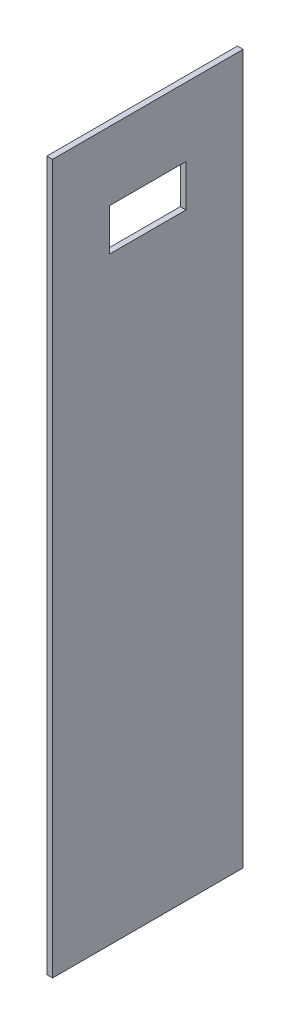
ISO-10303-21;
HEADER;
FILE_DESCRIPTION(('STEP AP214'),'2;1');
FILE_NAME('part.step','',(''),(''),'','','');
FILE_SCHEMA(('AUTOMOTIVE_DESIGN { 1 0 10303 214 1 1 1 1 }'));
ENDSEC;
DATA;
#1=APPLICATION_CONTEXT('core data for automotive mechanical design processes');
#2=APPLICATION_PROTOCOL_DEFINITION('international standard','automotive_design',2000,#1);
#3=PRODUCT_CONTEXT('',#1,'mechanical');
#4=PRODUCT('Part','Part','',(#3));
#5=PRODUCT_RELATED_PRODUCT_CATEGORY('part','',(#4));
#6=PRODUCT_DEFINITION_FORMATION('','',#4);
#7=PRODUCT_DEFINITION_CONTEXT('part definition',#1,'design');
#8=PRODUCT_DEFINITION('design','',#6,#7);
#9=PRODUCT_DEFINITION_SHAPE('','',#8);
#10=(LENGTH_UNIT() NAMED_UNIT(*) SI_UNIT(.MILLI.,.METRE.));
#11=(NAMED_UNIT(*) PLANE_ANGLE_UNIT() SI_UNIT($,.RADIAN.));
#12=(NAMED_UNIT(*) SI_UNIT($,.STERADIAN.) SOLID_ANGLE_UNIT());
#13=UNCERTAINTY_MEASURE_WITH_UNIT(LENGTH_MEASURE(1.E-05),#10,'distance_accuracy_value','');
#14=(GEOMETRIC_REPRESENTATION_CONTEXT(3) GLOBAL_UNCERTAINTY_ASSIGNED_CONTEXT((#13)) GLOBAL_UNIT_ASSIGNED_CONTEXT((#10,
#11,#12)) REPRESENTATION_CONTEXT('',''));
#15=CARTESIAN_POINT('',(0.,0.,0.));
#16=DIRECTION('',(0.,0.,1.));
#17=DIRECTION('',(1.,0.,0.));
#18=AXIS2_PLACEMENT_3D('',#15,#16,#17);
#19=CARTESIAN_POINT('',(0.749999999999997,93.,-25.));
#20=DIRECTION('',(-1.,0.,0.));
#21=DIRECTION('',(0.,0.,1.));
#22=AXIS2_PLACEMENT_3D('',#19,#20,#21);
#23=PLANE('',#22);
#24=DIRECTION('',(0.,0.,1.));
#25=VECTOR('',#24,1.);
#26=CARTESIAN_POINT('',(0.750000000000006,64.,10.));
#27=LINE('',#26,#25);
#28=CARTESIAN_POINT('',(0.750000000000004,64.,-10.));
#29=VERTEX_POINT('',#28);
#30=CARTESIAN_POINT('',(0.750000000000006,64.,10.));
#31=VERTEX_POINT('',#30);
#32=EDGE_CURVE('E105',#29,#31,#27,.T.);
#33=ORIENTED_EDGE('',*,*,#32,.T.);
#34=DIRECTION('',(0.,1.,0.));
#35=VECTOR('',#34,1.);
#36=CARTESIAN_POINT('',(0.750000000000006,75.,10.));
#37=LINE('',#36,#35);
#38=CARTESIAN_POINT('',(0.750000000000006,75.,10.));
#39=VERTEX_POINT('',#38);
#40=EDGE_CURVE('E99',#31,#39,#37,.T.);
#41=ORIENTED_EDGE('',*,*,#40,.T.);
#42=DIRECTION('',(0.,0.,-1.));
#43=VECTOR('',#42,1.);
#44=CARTESIAN_POINT('',(0.750000000000006,75.,10.));
#45=LINE('',#44,#43);
#46=CARTESIAN_POINT('',(0.749999999999999,75.,-10.));
#47=VERTEX_POINT('',#46);
#48=EDGE_CURVE('E108',#39,#47,#45,.T.);
#49=ORIENTED_EDGE('',*,*,#48,.T.);
#50=DIRECTION('',(0.,-1.,0.));
#51=VECTOR('',#50,1.);
#52=CARTESIAN_POINT('',(0.750000000000004,75.,-10.));
#53=LINE('',#52,#51);
#54=EDGE_CURVE('E47',#47,#29,#53,.T.);
#55=ORIENTED_EDGE('',*,*,#54,.T.);
#56=EDGE_LOOP('',(#33,#41,#49,#55));
#57=FACE_BOUND('',#56,.T.);
#58=DIRECTION('',(0.,0.,-1.));
#59=VECTOR('',#58,1.);
#60=CARTESIAN_POINT('',(0.749999999999997,-93.,-25.));
#61=LINE('',#60,#59);
#62=CARTESIAN_POINT('',(0.750000000000002,-93.,25.));
#63=VERTEX_POINT('',#62);
#64=CARTESIAN_POINT('',(0.749999999999997,-93.,-25.));
#65=VERTEX_POINT('',#64);
#66=EDGE_CURVE('E129',#63,#65,#61,.T.);
#67=ORIENTED_EDGE('',*,*,#66,.T.);
#68=DIRECTION('',(0.,-1.,0.));
#69=VECTOR('',#68,1.);
#70=CARTESIAN_POINT('',(0.749999999999997,93.,-25.));
#71=LINE('',#70,#69);
#72=CARTESIAN_POINT('',(0.749999999999997,93.,-25.));
#73=VERTEX_POINT('',#72);
#74=EDGE_CURVE('E11',#73,#65,#71,.T.);
#75=ORIENTED_EDGE('',*,*,#74,.F.);
#76=DIRECTION('',(0.,0.,-1.));
#77=VECTOR('',#76,1.);
#78=CARTESIAN_POINT('',(0.749999999999997,93.,-25.));
#79=LINE('',#78,#77);
#80=CARTESIAN_POINT('',(0.750000000000002,93.,25.));
#81=VERTEX_POINT('',#80);
#82=EDGE_CURVE('E133',#81,#73,#79,.T.);
#83=ORIENTED_EDGE('',*,*,#82,.F.);
#84=DIRECTION('',(0.,-1.,0.));
#85=VECTOR('',#84,1.);
#86=CARTESIAN_POINT('',(0.750000000000002,93.,25.));
#87=LINE('',#86,#85);
#88=EDGE_CURVE('E143',#81,#63,#87,.T.);
#89=ORIENTED_EDGE('',*,*,#88,.T.);
#90=EDGE_LOOP('',(#67,#75,#83,#89));
#91=FACE_BOUND('',#90,.T.);
#92=ADVANCED_FACE('F33',(#57,#91),#23,.F.);
#93=CARTESIAN_POINT('',(-0.750000000000002,93.,-25.));
#94=DIRECTION('',(0.,0.,1.));
#95=DIRECTION('',(1.,0.,0.));
#96=AXIS2_PLACEMENT_3D('',#93,#94,#95);
#97=PLANE('',#96);
#98=DIRECTION('',(-1.,0.,0.));
#99=VECTOR('',#98,1.);
#100=CARTESIAN_POINT('',(-0.750000000000002,-93.,-25.));
#101=LINE('',#100,#99);
#102=CARTESIAN_POINT('',(-0.750000000000002,-93.,-25.));
#103=VERTEX_POINT('',#102);
#104=EDGE_CURVE('E146',#65,#103,#101,.T.);
#105=ORIENTED_EDGE('',*,*,#104,.T.);
#106=DIRECTION('',(0.,-1.,0.));
#107=VECTOR('',#106,1.);
#108=CARTESIAN_POINT('',(-0.750000000000002,93.,-25.));
#109=LINE('',#108,#107);
#110=CARTESIAN_POINT('',(-0.750000000000002,93.,-25.));
#111=VERTEX_POINT('',#110);
#112=EDGE_CURVE('E40',#111,#103,#109,.T.);
#113=ORIENTED_EDGE('',*,*,#112,.F.);
#114=DIRECTION('',(-1.,0.,0.));
#115=VECTOR('',#114,1.);
#116=CARTESIAN_POINT('',(-0.750000000000002,93.,-25.));
#117=LINE('',#116,#115);
#118=EDGE_CURVE('E136',#73,#111,#117,.T.);
#119=ORIENTED_EDGE('',*,*,#118,.F.);
#120=ORIENTED_EDGE('',*,*,#74,.T.);
#121=EDGE_LOOP('',(#105,#113,#119,#120));
#122=FACE_BOUND('',#121,.T.);
#123=ADVANCED_FACE('F175',(#122),#97,.F.);
#124=CARTESIAN_POINT('',(-0.750000000000002,93.,-25.));
#125=DIRECTION('',(1.,0.,0.));
#126=DIRECTION('',(0.,0.,-1.));
#127=AXIS2_PLACEMENT_3D('',#124,#125,#126);
#128=PLANE('',#127);
#129=DIRECTION('',(0.,0.,-1.));
#130=VECTOR('',#129,1.);
#131=CARTESIAN_POINT('',(-0.749999999999999,75.,10.));
#132=LINE('',#131,#130);
#133=CARTESIAN_POINT('',(-0.749999999999999,75.,10.));
#134=VERTEX_POINT('',#133);
#135=CARTESIAN_POINT('',(-0.750000000000001,75.,-10.));
#136=VERTEX_POINT('',#135);
#137=EDGE_CURVE('E123',#134,#136,#132,.T.);
#138=ORIENTED_EDGE('',*,*,#137,.F.);
#139=DIRECTION('',(0.,1.,0.));
#140=VECTOR('',#139,1.);
#141=CARTESIAN_POINT('',(-0.749999999999999,75.,10.));
#142=LINE('',#141,#140);
#143=CARTESIAN_POINT('',(-0.749999999999999,64.,10.));
#144=VERTEX_POINT('',#143);
#145=EDGE_CURVE('E55',#144,#134,#142,.T.);
#146=ORIENTED_EDGE('',*,*,#145,.F.);
#147=DIRECTION('',(0.,0.,1.));
#148=VECTOR('',#147,1.);
#149=CARTESIAN_POINT('',(-0.749999999999999,64.,10.));
#150=LINE('',#149,#148);
#151=CARTESIAN_POINT('',(-0.750000000000001,64.,-10.));
#152=VERTEX_POINT('',#151);
#153=EDGE_CURVE('E114',#152,#144,#150,.T.);
#154=ORIENTED_EDGE('',*,*,#153,.F.);
#155=DIRECTION('',(0.,-1.,0.));
#156=VECTOR('',#155,1.);
#157=CARTESIAN_POINT('',(-0.750000000000001,75.,-10.));
#158=LINE('',#157,#156);
#159=EDGE_CURVE('E117',#136,#152,#158,.T.);
#160=ORIENTED_EDGE('',*,*,#159,.F.);
#161=EDGE_LOOP('',(#138,#146,#154,#160));
#162=FACE_BOUND('',#161,.T.);
#163=DIRECTION('',(0.,0.,1.));
#164=VECTOR('',#163,1.);
#165=CARTESIAN_POINT('',(-0.750000000000002,-93.,-25.));
#166=LINE('',#165,#164);
#167=CARTESIAN_POINT('',(-0.749999999999997,-93.,25.));
#168=VERTEX_POINT('',#167);
#169=EDGE_CURVE('E148',#103,#168,#166,.T.);
#170=ORIENTED_EDGE('',*,*,#169,.T.);
#171=DIRECTION('',(0.,-1.,0.));
#172=VECTOR('',#171,1.);
#173=CARTESIAN_POINT('',(-0.749999999999997,93.,25.));
#174=LINE('',#173,#172);
#175=CARTESIAN_POINT('',(-0.749999999999997,93.,25.));
#176=VERTEX_POINT('',#175);
#177=EDGE_CURVE('E153',#176,#168,#174,.T.);
#178=ORIENTED_EDGE('',*,*,#177,.F.);
#179=DIRECTION('',(0.,0.,1.));
#180=VECTOR('',#179,1.);
#181=CARTESIAN_POINT('',(-0.750000000000002,93.,-25.));
#182=LINE('',#181,#180);
#183=EDGE_CURVE('E139',#111,#176,#182,.T.);
#184=ORIENTED_EDGE('',*,*,#183,.F.);
#185=ORIENTED_EDGE('',*,*,#112,.T.);
#186=EDGE_LOOP('',(#170,#178,#184,#185));
#187=FACE_BOUND('',#186,.T.);
#188=ADVANCED_FACE('F160',(#162,#187),#128,.F.);
#189=CARTESIAN_POINT('',(-0.749999999999997,93.,25.));
#190=DIRECTION('',(0.,0.,-1.));
#191=DIRECTION('',(-1.,0.,0.));
#192=AXIS2_PLACEMENT_3D('',#189,#190,#191);
#193=PLANE('',#192);
#194=DIRECTION('',(1.,0.,0.));
#195=VECTOR('',#194,1.);
#196=CARTESIAN_POINT('',(-0.749999999999997,-93.,25.));
#197=LINE('',#196,#195);
#198=EDGE_CURVE('E137',#168,#63,#197,.T.);
#199=ORIENTED_EDGE('',*,*,#198,.T.);
#200=ORIENTED_EDGE('',*,*,#88,.F.);
#201=DIRECTION('',(1.,0.,0.));
#202=VECTOR('',#201,1.);
#203=CARTESIAN_POINT('',(-0.749999999999997,93.,25.));
#204=LINE('',#203,#202);
#205=EDGE_CURVE('E141',#176,#81,#204,.T.);
#206=ORIENTED_EDGE('',*,*,#205,.F.);
#207=ORIENTED_EDGE('',*,*,#177,.T.);
#208=EDGE_LOOP('',(#199,#200,#206,#207));
#209=FACE_BOUND('',#208,.T.);
#210=ADVANCED_FACE('F169',(#209),#193,.F.);
#211=CARTESIAN_POINT('',(0.,93.,0.));
#212=DIRECTION('',(0.,1.,0.));
#213=DIRECTION('',(0.,0.,1.));
#214=AXIS2_PLACEMENT_3D('',#211,#212,#213);
#215=PLANE('',#214);
#216=ORIENTED_EDGE('',*,*,#82,.T.);
#217=ORIENTED_EDGE('',*,*,#118,.T.);
#218=ORIENTED_EDGE('',*,*,#183,.T.);
#219=ORIENTED_EDGE('',*,*,#205,.T.);
#220=EDGE_LOOP('',(#216,#217,#218,#219));
#221=FACE_BOUND('',#220,.T.);
#222=ADVANCED_FACE('F174',(#221),#215,.T.);
#223=CARTESIAN_POINT('',(0.,-93.,0.));
#224=DIRECTION('',(0.,1.,0.));
#225=DIRECTION('',(0.,0.,1.));
#226=AXIS2_PLACEMENT_3D('',#223,#224,#225);
#227=PLANE('',#226);
#228=ORIENTED_EDGE('',*,*,#66,.F.);
#229=ORIENTED_EDGE('',*,*,#198,.F.);
#230=ORIENTED_EDGE('',*,*,#169,.F.);
#231=ORIENTED_EDGE('',*,*,#104,.F.);
#232=EDGE_LOOP('',(#228,#229,#230,#231));
#233=FACE_BOUND('',#232,.T.);
#234=ADVANCED_FACE('F166',(#233),#227,.F.);
#235=CARTESIAN_POINT('',(0.750000000000006,75.,10.));
#236=DIRECTION('',(0.,0.,1.));
#237=DIRECTION('',(1.,0.,0.));
#238=AXIS2_PLACEMENT_3D('',#235,#236,#237);
#239=PLANE('',#238);
#240=ORIENTED_EDGE('',*,*,#145,.T.);
#241=DIRECTION('',(-1.,0.,0.));
#242=VECTOR('',#241,1.);
#243=CARTESIAN_POINT('',(0.750000000000006,75.,10.));
#244=LINE('',#243,#242);
#245=EDGE_CURVE('E95',#39,#134,#244,.T.);
#246=ORIENTED_EDGE('',*,*,#245,.F.);
#247=ORIENTED_EDGE('',*,*,#40,.F.);
#248=DIRECTION('',(-1.,0.,0.));
#249=VECTOR('',#248,1.);
#250=CARTESIAN_POINT('',(0.750000000000006,64.,10.));
#251=LINE('',#250,#249);
#252=EDGE_CURVE('E127',#31,#144,#251,.T.);
#253=ORIENTED_EDGE('',*,*,#252,.T.);
#254=EDGE_LOOP('',(#240,#246,#247,#253));
#255=FACE_BOUND('',#254,.T.);
#256=ADVANCED_FACE('F97',(#255),#239,.F.);
#257=CARTESIAN_POINT('',(0.750000000000006,64.,10.));
#258=DIRECTION('',(0.,-1.,0.));
#259=DIRECTION('',(0.,0.,-1.));
#260=AXIS2_PLACEMENT_3D('',#257,#258,#259);
#261=PLANE('',#260);
#262=ORIENTED_EDGE('',*,*,#153,.T.);
#263=ORIENTED_EDGE('',*,*,#252,.F.);
#264=ORIENTED_EDGE('',*,*,#32,.F.);
#265=DIRECTION('',(-1.,0.,0.));
#266=VECTOR('',#265,1.);
#267=CARTESIAN_POINT('',(0.750000000000004,64.,-10.));
#268=LINE('',#267,#266);
#269=EDGE_CURVE('E130',#29,#152,#268,.T.);
#270=ORIENTED_EDGE('',*,*,#269,.T.);
#271=EDGE_LOOP('',(#262,#263,#264,#270));
#272=FACE_BOUND('',#271,.T.);
#273=ADVANCED_FACE('F192',(#272),#261,.F.);
#274=CARTESIAN_POINT('',(0.750000000000004,75.,-10.));
#275=DIRECTION('',(0.,0.,-1.));
#276=DIRECTION('',(0.,1.,0.));
#277=AXIS2_PLACEMENT_3D('',#274,#275,#276);
#278=PLANE('',#277);
#279=ORIENTED_EDGE('',*,*,#159,.T.);
#280=ORIENTED_EDGE('',*,*,#269,.F.);
#281=ORIENTED_EDGE('',*,*,#54,.F.);
#282=DIRECTION('',(-1.,0.,0.));
#283=VECTOR('',#282,1.);
#284=CARTESIAN_POINT('',(0.750000000000004,75.,-10.));
#285=LINE('',#284,#283);
#286=EDGE_CURVE('E104',#47,#136,#285,.T.);
#287=ORIENTED_EDGE('',*,*,#286,.T.);
#288=EDGE_LOOP('',(#279,#280,#281,#287));
#289=FACE_BOUND('',#288,.T.);
#290=ADVANCED_FACE('F195',(#289),#278,.F.);
#291=CARTESIAN_POINT('',(0.750000000000006,75.,10.));
#292=DIRECTION('',(0.,1.,0.));
#293=DIRECTION('',(0.,0.,1.));
#294=AXIS2_PLACEMENT_3D('',#291,#292,#293);
#295=PLANE('',#294);
#296=ORIENTED_EDGE('',*,*,#137,.T.);
#297=ORIENTED_EDGE('',*,*,#286,.F.);
#298=ORIENTED_EDGE('',*,*,#48,.F.);
#299=ORIENTED_EDGE('',*,*,#245,.T.);
#300=EDGE_LOOP('',(#296,#297,#298,#299));
#301=FACE_BOUND('',#300,.T.);
#302=ADVANCED_FACE('F109',(#301),#295,.F.);
#303=CLOSED_SHELL('',(#92,#123,#188,#210,#222,#234,#256,#273,#290,#302));
#304=MANIFOLD_SOLID_BREP('B2',#303);
#305=ADVANCED_BREP_SHAPE_REPRESENTATION('',(#18,#304),#14);
#306=SHAPE_DEFINITION_REPRESENTATION(#9,#305);
ENDSEC;
END-ISO-10303-21;
